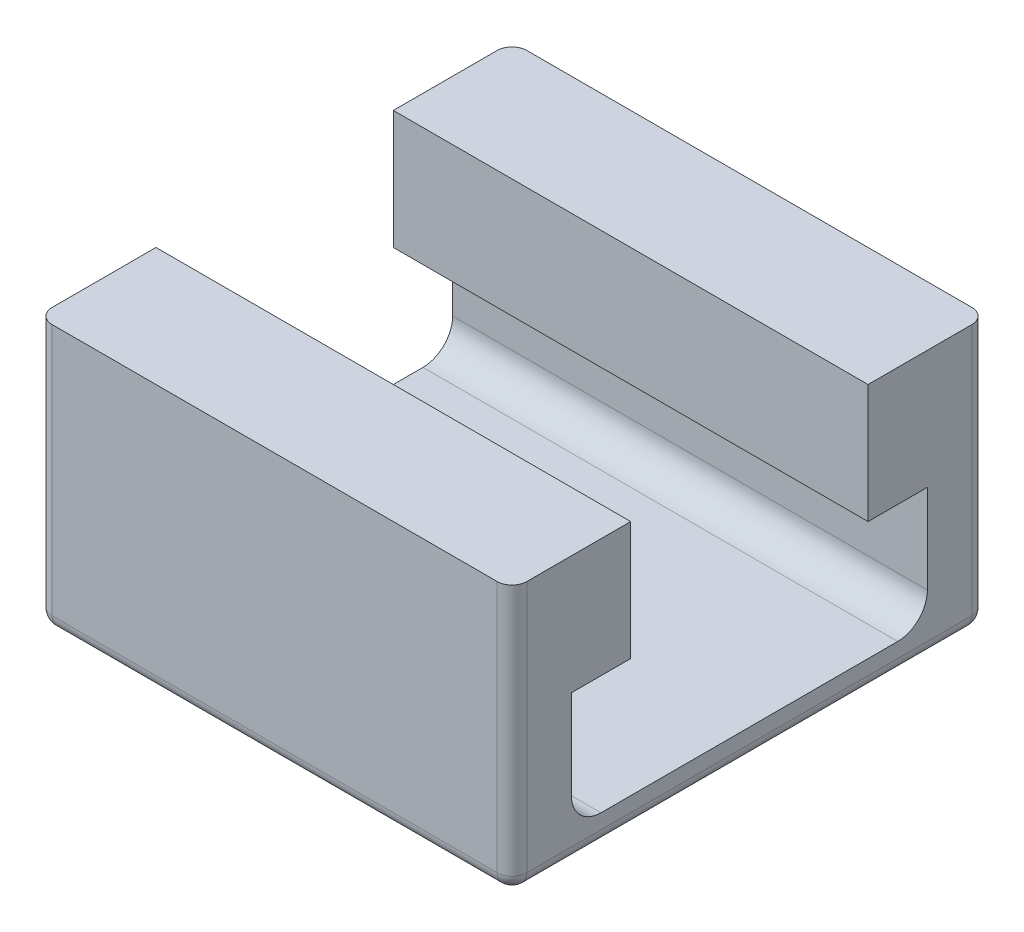
ISO-10303-21;
HEADER;
FILE_DESCRIPTION(('STEP AP214'),'2;1');
FILE_NAME('part.step','',(''),(''),'','','');
FILE_SCHEMA(('AUTOMOTIVE_DESIGN { 1 0 10303 214 1 1 1 1 }'));
ENDSEC;
DATA;
#1=APPLICATION_CONTEXT('core data for automotive mechanical design processes');
#2=APPLICATION_PROTOCOL_DEFINITION('international standard','automotive_design',2000,#1);
#3=PRODUCT_CONTEXT('',#1,'mechanical');
#4=PRODUCT('Part','Part','',(#3));
#5=PRODUCT_RELATED_PRODUCT_CATEGORY('part','',(#4));
#6=PRODUCT_DEFINITION_FORMATION('','',#4);
#7=PRODUCT_DEFINITION_CONTEXT('part definition',#1,'design');
#8=PRODUCT_DEFINITION('design','',#6,#7);
#9=PRODUCT_DEFINITION_SHAPE('','',#8);
#10=(LENGTH_UNIT() NAMED_UNIT(*) SI_UNIT(.MILLI.,.METRE.));
#11=(NAMED_UNIT(*) PLANE_ANGLE_UNIT() SI_UNIT($,.RADIAN.));
#12=(NAMED_UNIT(*) SI_UNIT($,.STERADIAN.) SOLID_ANGLE_UNIT());
#13=UNCERTAINTY_MEASURE_WITH_UNIT(LENGTH_MEASURE(1.E-05),#10,'distance_accuracy_value','');
#14=(GEOMETRIC_REPRESENTATION_CONTEXT(3) GLOBAL_UNCERTAINTY_ASSIGNED_CONTEXT((#13)) GLOBAL_UNIT_ASSIGNED_CONTEXT((#10,
#11,#12)) REPRESENTATION_CONTEXT('',''));
#15=CARTESIAN_POINT('',(0.,0.,0.));
#16=DIRECTION('',(0.,0.,1.));
#17=DIRECTION('',(1.,0.,0.));
#18=AXIS2_PLACEMENT_3D('',#15,#16,#17);
#19=CARTESIAN_POINT('',(-8.,0.,0.));
#20=DIRECTION('',(0.,-1.,0.));
#21=DIRECTION('',(0.,0.,-1.));
#22=AXIS2_PLACEMENT_3D('',#19,#20,#21);
#23=PLANE('',#22);
#24=DIRECTION('',(1.,0.,0.));
#25=VECTOR('',#24,1.);
#26=CARTESIAN_POINT('',(-8.,0.,-0.25));
#27=LINE('',#26,#25);
#28=CARTESIAN_POINT('',(-0.25,0.,-0.25));
#29=VERTEX_POINT('',#28);
#30=CARTESIAN_POINT('',(-7.75,0.,-0.25));
#31=VERTEX_POINT('',#30);
#32=EDGE_CURVE('E276',#29,#31,#27,.F.);
#33=ORIENTED_EDGE('',*,*,#32,.T.);
#34=DIRECTION('',(0.,0.,-1.));
#35=VECTOR('',#34,1.);
#36=CARTESIAN_POINT('',(-7.75,0.,-8.));
#37=LINE('',#36,#35);
#38=CARTESIAN_POINT('',(-7.75,0.,-7.75));
#39=VERTEX_POINT('',#38);
#40=EDGE_CURVE('E281',#31,#39,#37,.T.);
#41=ORIENTED_EDGE('',*,*,#40,.T.);
#42=DIRECTION('',(1.,0.,0.));
#43=VECTOR('',#42,1.);
#44=CARTESIAN_POINT('',(-8.,0.,-7.75));
#45=LINE('',#44,#43);
#46=CARTESIAN_POINT('',(-0.25,0.,-7.75));
#47=VERTEX_POINT('',#46);
#48=EDGE_CURVE('E278',#39,#47,#45,.T.);
#49=ORIENTED_EDGE('',*,*,#48,.T.);
#50=DIRECTION('',(0.,0.,-1.));
#51=VECTOR('',#50,1.);
#52=CARTESIAN_POINT('',(-0.25,0.,0.));
#53=LINE('',#52,#51);
#54=EDGE_CURVE('E255',#47,#29,#53,.F.);
#55=ORIENTED_EDGE('',*,*,#54,.T.);
#56=EDGE_LOOP('',(#33,#41,#49,#55));
#57=FACE_BOUND('',#56,.T.);
#58=ADVANCED_FACE('F32',(#57),#23,.T.);
#59=CARTESIAN_POINT('',(-8.,0.,0.));
#60=DIRECTION('',(0.,0.,1.));
#61=DIRECTION('',(1.,0.,0.));
#62=AXIS2_PLACEMENT_3D('',#59,#60,#61);
#63=PLANE('',#62);
#64=DIRECTION('',(1.,0.,0.));
#65=VECTOR('',#64,1.);
#66=CARTESIAN_POINT('',(-8.,4.5,0.));
#67=LINE('',#66,#65);
#68=CARTESIAN_POINT('',(-7.75,4.5,0.));
#69=VERTEX_POINT('',#68);
#70=CARTESIAN_POINT('',(-0.25,4.5,0.));
#71=VERTEX_POINT('',#70);
#72=EDGE_CURVE('E252',#69,#71,#67,.T.);
#73=ORIENTED_EDGE('',*,*,#72,.F.);
#74=DIRECTION('',(0.,-1.,0.));
#75=VECTOR('',#74,1.);
#76=CARTESIAN_POINT('',(-7.75,0.,0.));
#77=LINE('',#76,#75);
#78=CARTESIAN_POINT('',(-7.75,0.25,0.));
#79=VERTEX_POINT('',#78);
#80=EDGE_CURVE('E303',#69,#79,#77,.T.);
#81=ORIENTED_EDGE('',*,*,#80,.T.);
#82=DIRECTION('',(1.,0.,0.));
#83=VECTOR('',#82,1.);
#84=CARTESIAN_POINT('',(-8.,0.25,0.));
#85=LINE('',#84,#83);
#86=CARTESIAN_POINT('',(-0.25,0.25,0.));
#87=VERTEX_POINT('',#86);
#88=EDGE_CURVE('E301',#79,#87,#85,.T.);
#89=ORIENTED_EDGE('',*,*,#88,.T.);
#90=DIRECTION('',(0.,-1.,0.));
#91=VECTOR('',#90,1.);
#92=CARTESIAN_POINT('',(-0.25,0.,0.));
#93=LINE('',#92,#91);
#94=EDGE_CURVE('E299',#87,#71,#93,.F.);
#95=ORIENTED_EDGE('',*,*,#94,.T.);
#96=EDGE_LOOP('',(#73,#81,#89,#95));
#97=FACE_BOUND('',#96,.T.);
#98=ADVANCED_FACE('F367',(#97),#63,.T.);
#99=CARTESIAN_POINT('',(-8.,4.5,0.));
#100=DIRECTION('',(0.,1.,0.));
#101=DIRECTION('',(0.,0.,1.));
#102=AXIS2_PLACEMENT_3D('',#99,#100,#101);
#103=PLANE('',#102);
#104=DIRECTION('',(0.,0.,1.));
#105=VECTOR('',#104,1.);
#106=CARTESIAN_POINT('',(-8.,4.5,0.));
#107=LINE('',#106,#105);
#108=CARTESIAN_POINT('',(-8.,4.5,-1.99999999999999));
#109=VERTEX_POINT('',#108);
#110=CARTESIAN_POINT('',(-8.,4.5,-0.25));
#111=VERTEX_POINT('',#110);
#112=EDGE_CURVE('E221',#109,#111,#107,.T.);
#113=ORIENTED_EDGE('',*,*,#112,.T.);
#114=CARTESIAN_POINT('',(-7.75,4.5,-0.25));
#115=DIRECTION('',(0.,1.,0.));
#116=DIRECTION('',(0.,0.,1.));
#117=AXIS2_PLACEMENT_3D('',#114,#115,#116);
#118=CIRCLE('',#117,0.25);
#119=EDGE_CURVE('E307',#111,#69,#118,.T.);
#120=ORIENTED_EDGE('',*,*,#119,.T.);
#121=ORIENTED_EDGE('',*,*,#72,.T.);
#122=CARTESIAN_POINT('',(-0.25,4.5,-0.25));
#123=DIRECTION('',(0.,1.,0.));
#124=DIRECTION('',(0.,0.,1.));
#125=AXIS2_PLACEMENT_3D('',#122,#123,#124);
#126=CIRCLE('',#125,0.25);
#127=CARTESIAN_POINT('',(0.,4.5,-0.25));
#128=VERTEX_POINT('',#127);
#129=EDGE_CURVE('E305',#71,#128,#126,.T.);
#130=ORIENTED_EDGE('',*,*,#129,.T.);
#131=DIRECTION('',(0.,0.,1.));
#132=VECTOR('',#131,1.);
#133=CARTESIAN_POINT('',(0.,4.5,0.));
#134=LINE('',#133,#132);
#135=CARTESIAN_POINT('',(0.,4.5,-1.99999999999999));
#136=VERTEX_POINT('',#135);
#137=EDGE_CURVE('E182',#136,#128,#134,.T.);
#138=ORIENTED_EDGE('',*,*,#137,.F.);
#139=DIRECTION('',(1.,0.,0.));
#140=VECTOR('',#139,1.);
#141=CARTESIAN_POINT('',(-8.,4.5,-1.99999999999999));
#142=LINE('',#141,#140);
#143=EDGE_CURVE('E256',#109,#136,#142,.T.);
#144=ORIENTED_EDGE('',*,*,#143,.F.);
#145=EDGE_LOOP('',(#113,#120,#121,#130,#138,#144));
#146=FACE_BOUND('',#145,.T.);
#147=ADVANCED_FACE('F374',(#146),#103,.T.);
#148=CARTESIAN_POINT('',(-8.,4.5,-1.99999999999999));
#149=DIRECTION('',(0.,0.,-1.));
#150=DIRECTION('',(-1.,0.,0.));
#151=AXIS2_PLACEMENT_3D('',#148,#149,#150);
#152=PLANE('',#151);
#153=DIRECTION('',(0.,1.,0.));
#154=VECTOR('',#153,1.);
#155=CARTESIAN_POINT('',(0.,4.5,-1.99999999999999));
#156=LINE('',#155,#154);
#157=CARTESIAN_POINT('',(0.,2.50000000000034,-1.99999999999999));
#158=VERTEX_POINT('',#157);
#159=EDGE_CURVE('E248',#158,#136,#156,.T.);
#160=ORIENTED_EDGE('',*,*,#159,.F.);
#161=DIRECTION('',(1.,0.,0.));
#162=VECTOR('',#161,1.);
#163=CARTESIAN_POINT('',(-8.,2.50000000000034,-1.99999999999999));
#164=LINE('',#163,#162);
#165=CARTESIAN_POINT('',(-8.,2.50000000000034,-1.99999999999999));
#166=VERTEX_POINT('',#165);
#167=EDGE_CURVE('E258',#166,#158,#164,.T.);
#168=ORIENTED_EDGE('',*,*,#167,.F.);
#169=DIRECTION('',(0.,1.,0.));
#170=VECTOR('',#169,1.);
#171=CARTESIAN_POINT('',(-8.,4.5,-1.99999999999999));
#172=LINE('',#171,#170);
#173=EDGE_CURVE('E218',#166,#109,#172,.T.);
#174=ORIENTED_EDGE('',*,*,#173,.T.);
#175=ORIENTED_EDGE('',*,*,#143,.T.);
#176=EDGE_LOOP('',(#160,#168,#174,#175));
#177=FACE_BOUND('',#176,.T.);
#178=ADVANCED_FACE('F379',(#177),#152,.T.);
#179=CARTESIAN_POINT('',(-8.,2.50000000000034,-1.99999999999999));
#180=DIRECTION('',(0.,-1.,0.));
#181=DIRECTION('',(0.,0.,-1.));
#182=AXIS2_PLACEMENT_3D('',#179,#180,#181);
#183=PLANE('',#182);
#184=DIRECTION('',(0.,0.,-1.));
#185=VECTOR('',#184,1.);
#186=CARTESIAN_POINT('',(0.,2.50000000000034,-1.99999999999999));
#187=LINE('',#186,#185);
#188=CARTESIAN_POINT('',(0.,2.50000000000034,-1.));
#189=VERTEX_POINT('',#188);
#190=EDGE_CURVE('E245',#189,#158,#187,.T.);
#191=ORIENTED_EDGE('',*,*,#190,.F.);
#192=DIRECTION('',(1.,0.,0.));
#193=VECTOR('',#192,1.);
#194=CARTESIAN_POINT('',(-8.,2.50000000000034,-1.));
#195=LINE('',#194,#193);
#196=CARTESIAN_POINT('',(-8.,2.50000000000034,-1.));
#197=VERTEX_POINT('',#196);
#198=EDGE_CURVE('E260',#197,#189,#195,.T.);
#199=ORIENTED_EDGE('',*,*,#198,.F.);
#200=DIRECTION('',(0.,0.,-1.));
#201=VECTOR('',#200,1.);
#202=CARTESIAN_POINT('',(-8.,2.50000000000034,-1.99999999999999));
#203=LINE('',#202,#201);
#204=EDGE_CURVE('E215',#197,#166,#203,.T.);
#205=ORIENTED_EDGE('',*,*,#204,.T.);
#206=ORIENTED_EDGE('',*,*,#167,.T.);
#207=EDGE_LOOP('',(#191,#199,#205,#206));
#208=FACE_BOUND('',#207,.T.);
#209=ADVANCED_FACE('F588',(#208),#183,.T.);
#210=CARTESIAN_POINT('',(-8.,2.50000000000034,-1.));
#211=DIRECTION('',(0.,0.,-1.));
#212=DIRECTION('',(-1.,0.,0.));
#213=AXIS2_PLACEMENT_3D('',#210,#211,#212);
#214=PLANE('',#213);
#215=DIRECTION('',(0.,1.,0.));
#216=VECTOR('',#215,1.);
#217=CARTESIAN_POINT('',(0.,2.50000000000034,-1.));
#218=LINE('',#217,#216);
#219=CARTESIAN_POINT('',(0.,1.,-1.));
#220=VERTEX_POINT('',#219);
#221=EDGE_CURVE('E242',#220,#189,#218,.T.);
#222=ORIENTED_EDGE('',*,*,#221,.F.);
#223=DIRECTION('',(1.,0.,0.));
#224=VECTOR('',#223,1.);
#225=CARTESIAN_POINT('',(-8.,1.,-1.));
#226=LINE('',#225,#224);
#227=CARTESIAN_POINT('',(-8.,1.,-1.));
#228=VERTEX_POINT('',#227);
#229=EDGE_CURVE('E262',#228,#220,#226,.T.);
#230=ORIENTED_EDGE('',*,*,#229,.F.);
#231=DIRECTION('',(0.,1.,0.));
#232=VECTOR('',#231,1.);
#233=CARTESIAN_POINT('',(-8.,2.50000000000034,-1.));
#234=LINE('',#233,#232);
#235=EDGE_CURVE('E212',#228,#197,#234,.T.);
#236=ORIENTED_EDGE('',*,*,#235,.T.);
#237=ORIENTED_EDGE('',*,*,#198,.T.);
#238=EDGE_LOOP('',(#222,#230,#236,#237));
#239=FACE_BOUND('',#238,.T.);
#240=ADVANCED_FACE('F579',(#239),#214,.T.);
#241=CARTESIAN_POINT('',(-8.,1.,-1.5));
#242=DIRECTION('',(1.,0.,0.));
#243=DIRECTION('',(0.,0.,-1.));
#244=AXIS2_PLACEMENT_3D('',#241,#242,#243);
#245=CYLINDRICAL_SURFACE('',#244,0.5);
#246=CARTESIAN_POINT('',(0.,1.,-1.5));
#247=DIRECTION('',(-1.,0.,0.));
#248=DIRECTION('',(0.,0.,-1.));
#249=AXIS2_PLACEMENT_3D('',#246,#247,#248);
#250=CIRCLE('',#249,0.5);
#251=CARTESIAN_POINT('',(0.,0.500000000000004,-1.5));
#252=VERTEX_POINT('',#251);
#253=EDGE_CURVE('E239',#252,#220,#250,.T.);
#254=ORIENTED_EDGE('',*,*,#253,.F.);
#255=DIRECTION('',(1.,0.,0.));
#256=VECTOR('',#255,1.);
#257=CARTESIAN_POINT('',(-8.,0.500000000000004,-1.5));
#258=LINE('',#257,#256);
#259=CARTESIAN_POINT('',(-8.,0.500000000000004,-1.5));
#260=VERTEX_POINT('',#259);
#261=EDGE_CURVE('E264',#260,#252,#258,.T.);
#262=ORIENTED_EDGE('',*,*,#261,.F.);
#263=CARTESIAN_POINT('',(-8.,1.,-1.5));
#264=DIRECTION('',(-1.,0.,0.));
#265=DIRECTION('',(0.,0.,-1.));
#266=AXIS2_PLACEMENT_3D('',#263,#264,#265);
#267=CIRCLE('',#266,0.5);
#268=EDGE_CURVE('E209',#260,#228,#267,.T.);
#269=ORIENTED_EDGE('',*,*,#268,.T.);
#270=ORIENTED_EDGE('',*,*,#229,.T.);
#271=EDGE_LOOP('',(#254,#262,#269,#270));
#272=FACE_BOUND('',#271,.T.);
#273=ADVANCED_FACE('F570',(#272),#245,.F.);
#274=CARTESIAN_POINT('',(-8.,0.500000000000004,-6.50000000000003));
#275=DIRECTION('',(0.,1.,0.));
#276=DIRECTION('',(0.,0.,1.));
#277=AXIS2_PLACEMENT_3D('',#274,#275,#276);
#278=PLANE('',#277);
#279=DIRECTION('',(0.,0.,1.));
#280=VECTOR('',#279,1.);
#281=CARTESIAN_POINT('',(0.,0.500000000000004,-6.50000000000003));
#282=LINE('',#281,#280);
#283=CARTESIAN_POINT('',(0.,0.500000000000004,-6.50000000000003));
#284=VERTEX_POINT('',#283);
#285=EDGE_CURVE('E236',#284,#252,#282,.T.);
#286=ORIENTED_EDGE('',*,*,#285,.F.);
#287=DIRECTION('',(1.,0.,0.));
#288=VECTOR('',#287,1.);
#289=CARTESIAN_POINT('',(-8.,0.500000000000004,-6.50000000000003));
#290=LINE('',#289,#288);
#291=CARTESIAN_POINT('',(-8.,0.500000000000004,-6.50000000000003));
#292=VERTEX_POINT('',#291);
#293=EDGE_CURVE('E266',#292,#284,#290,.T.);
#294=ORIENTED_EDGE('',*,*,#293,.F.);
#295=DIRECTION('',(0.,0.,1.));
#296=VECTOR('',#295,1.);
#297=CARTESIAN_POINT('',(-8.,0.500000000000004,-6.50000000000003));
#298=LINE('',#297,#296);
#299=EDGE_CURVE('E206',#292,#260,#298,.T.);
#300=ORIENTED_EDGE('',*,*,#299,.T.);
#301=ORIENTED_EDGE('',*,*,#261,.T.);
#302=EDGE_LOOP('',(#286,#294,#300,#301));
#303=FACE_BOUND('',#302,.T.);
#304=ADVANCED_FACE('F561',(#303),#278,.T.);
#305=CARTESIAN_POINT('',(-8.,1.,-6.50000000000003));
#306=DIRECTION('',(1.,0.,0.));
#307=DIRECTION('',(0.,0.,-1.));
#308=AXIS2_PLACEMENT_3D('',#305,#306,#307);
#309=CYLINDRICAL_SURFACE('',#308,0.499999999999999);
#310=CARTESIAN_POINT('',(0.,1.,-6.50000000000003));
#311=DIRECTION('',(-1.,0.,0.));
#312=DIRECTION('',(0.,0.,-1.));
#313=AXIS2_PLACEMENT_3D('',#310,#311,#312);
#314=CIRCLE('',#313,0.499999999999999);
#315=CARTESIAN_POINT('',(0.,1.,-7.00000000000002));
#316=VERTEX_POINT('',#315);
#317=EDGE_CURVE('E233',#316,#284,#314,.T.);
#318=ORIENTED_EDGE('',*,*,#317,.F.);
#319=DIRECTION('',(1.,0.,0.));
#320=VECTOR('',#319,1.);
#321=CARTESIAN_POINT('',(-8.,1.,-7.00000000000002));
#322=LINE('',#321,#320);
#323=CARTESIAN_POINT('',(-8.,1.,-7.00000000000002));
#324=VERTEX_POINT('',#323);
#325=EDGE_CURVE('E268',#324,#316,#322,.T.);
#326=ORIENTED_EDGE('',*,*,#325,.F.);
#327=CARTESIAN_POINT('',(-8.,1.,-6.50000000000003));
#328=DIRECTION('',(-1.,0.,0.));
#329=DIRECTION('',(0.,0.,-1.));
#330=AXIS2_PLACEMENT_3D('',#327,#328,#329);
#331=CIRCLE('',#330,0.499999999999999);
#332=EDGE_CURVE('E203',#324,#292,#331,.T.);
#333=ORIENTED_EDGE('',*,*,#332,.T.);
#334=ORIENTED_EDGE('',*,*,#293,.T.);
#335=EDGE_LOOP('',(#318,#326,#333,#334));
#336=FACE_BOUND('',#335,.T.);
#337=ADVANCED_FACE('F552',(#336),#309,.F.);
#338=CARTESIAN_POINT('',(-8.,2.5,-7.00000000000003));
#339=DIRECTION('',(0.,0.,1.));
#340=DIRECTION('',(1.,0.,0.));
#341=AXIS2_PLACEMENT_3D('',#338,#339,#340);
#342=PLANE('',#341);
#343=DIRECTION('',(0.,-1.,0.));
#344=VECTOR('',#343,1.);
#345=CARTESIAN_POINT('',(0.,2.5,-7.00000000000003));
#346=LINE('',#345,#344);
#347=CARTESIAN_POINT('',(0.,2.5,-7.00000000000003));
#348=VERTEX_POINT('',#347);
#349=EDGE_CURVE('E230',#348,#316,#346,.T.);
#350=ORIENTED_EDGE('',*,*,#349,.F.);
#351=DIRECTION('',(1.,0.,0.));
#352=VECTOR('',#351,1.);
#353=CARTESIAN_POINT('',(-8.,2.5,-7.00000000000003));
#354=LINE('',#353,#352);
#355=CARTESIAN_POINT('',(-8.,2.5,-7.00000000000003));
#356=VERTEX_POINT('',#355);
#357=EDGE_CURVE('E270',#356,#348,#354,.T.);
#358=ORIENTED_EDGE('',*,*,#357,.F.);
#359=DIRECTION('',(0.,-1.,0.));
#360=VECTOR('',#359,1.);
#361=CARTESIAN_POINT('',(-8.,2.5,-7.00000000000003));
#362=LINE('',#361,#360);
#363=EDGE_CURVE('E198',#356,#324,#362,.T.);
#364=ORIENTED_EDGE('',*,*,#363,.T.);
#365=ORIENTED_EDGE('',*,*,#325,.T.);
#366=EDGE_LOOP('',(#350,#358,#364,#365));
#367=FACE_BOUND('',#366,.T.);
#368=ADVANCED_FACE('F543',(#367),#342,.T.);
#369=CARTESIAN_POINT('',(-8.,2.5,-6.));
#370=DIRECTION('',(0.,-1.,0.));
#371=DIRECTION('',(0.,0.,-1.));
#372=AXIS2_PLACEMENT_3D('',#369,#370,#371);
#373=PLANE('',#372);
#374=DIRECTION('',(0.,0.,-1.));
#375=VECTOR('',#374,1.);
#376=CARTESIAN_POINT('',(0.,2.5,-6.));
#377=LINE('',#376,#375);
#378=CARTESIAN_POINT('',(0.,2.5,-6.));
#379=VERTEX_POINT('',#378);
#380=EDGE_CURVE('E227',#379,#348,#377,.T.);
#381=ORIENTED_EDGE('',*,*,#380,.F.);
#382=DIRECTION('',(1.,0.,0.));
#383=VECTOR('',#382,1.);
#384=CARTESIAN_POINT('',(-8.,2.5,-6.));
#385=LINE('',#384,#383);
#386=CARTESIAN_POINT('',(-8.,2.5,-6.));
#387=VERTEX_POINT('',#386);
#388=EDGE_CURVE('E189',#387,#379,#385,.T.);
#389=ORIENTED_EDGE('',*,*,#388,.F.);
#390=DIRECTION('',(0.,0.,-1.));
#391=VECTOR('',#390,1.);
#392=CARTESIAN_POINT('',(-8.,2.5,-6.));
#393=LINE('',#392,#391);
#394=EDGE_CURVE('E196',#387,#356,#393,.T.);
#395=ORIENTED_EDGE('',*,*,#394,.T.);
#396=ORIENTED_EDGE('',*,*,#357,.T.);
#397=EDGE_LOOP('',(#381,#389,#395,#396));
#398=FACE_BOUND('',#397,.T.);
#399=ADVANCED_FACE('F535',(#398),#373,.T.);
#400=CARTESIAN_POINT('',(-8.,4.50000000000023,-6.));
#401=DIRECTION('',(0.,0.,1.));
#402=DIRECTION('',(1.,0.,0.));
#403=AXIS2_PLACEMENT_3D('',#400,#401,#402);
#404=PLANE('',#403);
#405=DIRECTION('',(0.,-1.,0.));
#406=VECTOR('',#405,1.);
#407=CARTESIAN_POINT('',(0.,4.50000000000023,-6.));
#408=LINE('',#407,#406);
#409=CARTESIAN_POINT('',(0.,4.50000000000023,-6.));
#410=VERTEX_POINT('',#409);
#411=EDGE_CURVE('E188',#410,#379,#408,.T.);
#412=ORIENTED_EDGE('',*,*,#411,.F.);
#413=DIRECTION('',(1.,0.,0.));
#414=VECTOR('',#413,1.);
#415=CARTESIAN_POINT('',(-8.,4.50000000000023,-6.));
#416=LINE('',#415,#414);
#417=CARTESIAN_POINT('',(-8.,4.50000000000023,-6.));
#418=VERTEX_POINT('',#417);
#419=EDGE_CURVE('E174',#418,#410,#416,.T.);
#420=ORIENTED_EDGE('',*,*,#419,.F.);
#421=DIRECTION('',(0.,-1.,0.));
#422=VECTOR('',#421,1.);
#423=CARTESIAN_POINT('',(-8.,4.50000000000023,-6.));
#424=LINE('',#423,#422);
#425=EDGE_CURVE('E181',#418,#387,#424,.T.);
#426=ORIENTED_EDGE('',*,*,#425,.T.);
#427=ORIENTED_EDGE('',*,*,#388,.T.);
#428=EDGE_LOOP('',(#412,#420,#426,#427));
#429=FACE_BOUND('',#428,.T.);
#430=ADVANCED_FACE('F186',(#429),#404,.T.);
#431=CARTESIAN_POINT('',(-8.,4.50000000000023,-8.));
#432=DIRECTION('',(0.,1.,0.));
#433=DIRECTION('',(0.,0.,1.));
#434=AXIS2_PLACEMENT_3D('',#431,#432,#433);
#435=PLANE('',#434);
#436=DIRECTION('',(1.,0.,0.));
#437=VECTOR('',#436,1.);
#438=CARTESIAN_POINT('',(-8.,4.50000000000023,-8.));
#439=LINE('',#438,#437);
#440=CARTESIAN_POINT('',(-7.75,4.50000000000023,-8.));
#441=VERTEX_POINT('',#440);
#442=CARTESIAN_POINT('',(-0.25,4.50000000000023,-8.));
#443=VERTEX_POINT('',#442);
#444=EDGE_CURVE('E190',#441,#443,#439,.T.);
#445=ORIENTED_EDGE('',*,*,#444,.F.);
#446=CARTESIAN_POINT('',(-7.75,4.50000000000023,-7.75));
#447=DIRECTION('',(0.,1.,0.));
#448=DIRECTION('',(0.,0.,1.));
#449=AXIS2_PLACEMENT_3D('',#446,#447,#448);
#450=CIRCLE('',#449,0.25);
#451=CARTESIAN_POINT('',(-8.,4.50000000000023,-7.75));
#452=VERTEX_POINT('',#451);
#453=EDGE_CURVE('E177',#441,#452,#450,.T.);
#454=ORIENTED_EDGE('',*,*,#453,.T.);
#455=DIRECTION('',(0.,0.,1.));
#456=VECTOR('',#455,1.);
#457=CARTESIAN_POINT('',(-8.,4.50000000000023,-8.));
#458=LINE('',#457,#456);
#459=EDGE_CURVE('E169',#452,#418,#458,.T.);
#460=ORIENTED_EDGE('',*,*,#459,.T.);
#461=ORIENTED_EDGE('',*,*,#419,.T.);
#462=DIRECTION('',(0.,0.,1.));
#463=VECTOR('',#462,1.);
#464=CARTESIAN_POINT('',(0.,4.50000000000023,-8.));
#465=LINE('',#464,#463);
#466=CARTESIAN_POINT('',(0.,4.50000000000023,-7.75));
#467=VERTEX_POINT('',#466);
#468=EDGE_CURVE('E224',#467,#410,#465,.T.);
#469=ORIENTED_EDGE('',*,*,#468,.F.);
#470=CARTESIAN_POINT('',(-0.25,4.50000000000023,-7.75));
#471=DIRECTION('',(0.,1.,0.));
#472=DIRECTION('',(0.,0.,1.));
#473=AXIS2_PLACEMENT_3D('',#470,#471,#472);
#474=CIRCLE('',#473,0.25);
#475=EDGE_CURVE('E290',#467,#443,#474,.T.);
#476=ORIENTED_EDGE('',*,*,#475,.T.);
#477=EDGE_LOOP('',(#445,#454,#460,#461,#469,#476));
#478=FACE_BOUND('',#477,.T.);
#479=ADVANCED_FACE('F172',(#478),#435,.T.);
#480=CARTESIAN_POINT('',(-8.,0.,-8.));
#481=DIRECTION('',(0.,0.,-1.));
#482=DIRECTION('',(-1.,0.,0.));
#483=AXIS2_PLACEMENT_3D('',#480,#481,#482);
#484=PLANE('',#483);
#485=DIRECTION('',(1.,0.,0.));
#486=VECTOR('',#485,1.);
#487=CARTESIAN_POINT('',(-8.,0.25,-8.));
#488=LINE('',#487,#486);
#489=CARTESIAN_POINT('',(-0.25,0.25,-8.));
#490=VERTEX_POINT('',#489);
#491=CARTESIAN_POINT('',(-7.75,0.25,-8.));
#492=VERTEX_POINT('',#491);
#493=EDGE_CURVE('E285',#490,#492,#488,.F.);
#494=ORIENTED_EDGE('',*,*,#493,.T.);
#495=DIRECTION('',(0.,1.,0.));
#496=VECTOR('',#495,1.);
#497=CARTESIAN_POINT('',(-7.75,4.50000000000023,-8.));
#498=LINE('',#497,#496);
#499=EDGE_CURVE('E288',#492,#441,#498,.T.);
#500=ORIENTED_EDGE('',*,*,#499,.T.);
#501=ORIENTED_EDGE('',*,*,#444,.T.);
#502=DIRECTION('',(0.,1.,0.));
#503=VECTOR('',#502,1.);
#504=CARTESIAN_POINT('',(-0.25,0.,-8.));
#505=LINE('',#504,#503);
#506=EDGE_CURVE('E283',#443,#490,#505,.F.);
#507=ORIENTED_EDGE('',*,*,#506,.T.);
#508=EDGE_LOOP('',(#494,#500,#501,#507));
#509=FACE_BOUND('',#508,.T.);
#510=ADVANCED_FACE('F398',(#509),#484,.T.);
#511=CARTESIAN_POINT('',(-8.,1.,-6.50000000000003));
#512=DIRECTION('',(1.,0.,0.));
#513=DIRECTION('',(0.,0.,-1.));
#514=AXIS2_PLACEMENT_3D('',#511,#512,#513);
#515=PLANE('',#514);
#516=ORIENTED_EDGE('',*,*,#459,.F.);
#517=DIRECTION('',(0.,1.,0.));
#518=VECTOR('',#517,1.);
#519=CARTESIAN_POINT('',(-8.,0.,-7.75));
#520=LINE('',#519,#518);
#521=CARTESIAN_POINT('',(-8.,0.25,-7.75));
#522=VERTEX_POINT('',#521);
#523=EDGE_CURVE('E297',#452,#522,#520,.F.);
#524=ORIENTED_EDGE('',*,*,#523,.T.);
#525=DIRECTION('',(0.,0.,-1.));
#526=VECTOR('',#525,1.);
#527=CARTESIAN_POINT('',(-8.,0.25,0.));
#528=LINE('',#527,#526);
#529=CARTESIAN_POINT('',(-8.,0.25,-0.25));
#530=VERTEX_POINT('',#529);
#531=EDGE_CURVE('E295',#522,#530,#528,.F.);
#532=ORIENTED_EDGE('',*,*,#531,.T.);
#533=DIRECTION('',(0.,-1.,0.));
#534=VECTOR('',#533,1.);
#535=CARTESIAN_POINT('',(-8.,4.5,-0.25));
#536=LINE('',#535,#534);
#537=EDGE_CURVE('E293',#530,#111,#536,.F.);
#538=ORIENTED_EDGE('',*,*,#537,.T.);
#539=ORIENTED_EDGE('',*,*,#112,.F.);
#540=ORIENTED_EDGE('',*,*,#173,.F.);
#541=ORIENTED_EDGE('',*,*,#204,.F.);
#542=ORIENTED_EDGE('',*,*,#235,.F.);
#543=ORIENTED_EDGE('',*,*,#268,.F.);
#544=ORIENTED_EDGE('',*,*,#299,.F.);
#545=ORIENTED_EDGE('',*,*,#332,.F.);
#546=ORIENTED_EDGE('',*,*,#363,.F.);
#547=ORIENTED_EDGE('',*,*,#394,.F.);
#548=ORIENTED_EDGE('',*,*,#425,.F.);
#549=EDGE_LOOP('',(#516,#524,#532,#538,#539,#540,#541,#542,#543,#544,#545,#546,#547,#548));
#550=FACE_BOUND('',#549,.T.);
#551=ADVANCED_FACE('F193',(#550),#515,.F.);
#552=CARTESIAN_POINT('',(0.,1.,-6.50000000000003));
#553=DIRECTION('',(1.,0.,0.));
#554=DIRECTION('',(0.,0.,-1.));
#555=AXIS2_PLACEMENT_3D('',#552,#553,#554);
#556=PLANE('',#555);
#557=DIRECTION('',(0.,0.,-1.));
#558=VECTOR('',#557,1.);
#559=CARTESIAN_POINT('',(0.,0.25,-6.50000000000003));
#560=LINE('',#559,#558);
#561=CARTESIAN_POINT('',(0.,0.25,-0.25));
#562=VERTEX_POINT('',#561);
#563=CARTESIAN_POINT('',(0.,0.25,-7.75));
#564=VERTEX_POINT('',#563);
#565=EDGE_CURVE('E41',#562,#564,#560,.T.);
#566=ORIENTED_EDGE('',*,*,#565,.T.);
#567=DIRECTION('',(0.,1.,0.));
#568=VECTOR('',#567,1.);
#569=CARTESIAN_POINT('',(0.,1.,-7.75));
#570=LINE('',#569,#568);
#571=EDGE_CURVE('E11',#564,#467,#570,.T.);
#572=ORIENTED_EDGE('',*,*,#571,.T.);
#573=ORIENTED_EDGE('',*,*,#468,.T.);
#574=ORIENTED_EDGE('',*,*,#411,.T.);
#575=ORIENTED_EDGE('',*,*,#380,.T.);
#576=ORIENTED_EDGE('',*,*,#349,.T.);
#577=ORIENTED_EDGE('',*,*,#317,.T.);
#578=ORIENTED_EDGE('',*,*,#285,.T.);
#579=ORIENTED_EDGE('',*,*,#253,.T.);
#580=ORIENTED_EDGE('',*,*,#221,.T.);
#581=ORIENTED_EDGE('',*,*,#190,.T.);
#582=ORIENTED_EDGE('',*,*,#159,.T.);
#583=ORIENTED_EDGE('',*,*,#137,.T.);
#584=DIRECTION('',(0.,-1.,0.));
#585=VECTOR('',#584,1.);
#586=CARTESIAN_POINT('',(0.,1.,-0.25));
#587=LINE('',#586,#585);
#588=EDGE_CURVE('E52',#128,#562,#587,.T.);
#589=ORIENTED_EDGE('',*,*,#588,.T.);
#590=EDGE_LOOP('',(#566,#572,#573,#574,#575,#576,#577,#578,#579,#580,#581,#582,#583,#589));
#591=FACE_BOUND('',#590,.T.);
#592=ADVANCED_FACE('F375',(#591),#556,.T.);
#593=CARTESIAN_POINT('',(-7.75,0.,-0.25));
#594=DIRECTION('',(0.,1.,0.));
#595=DIRECTION('',(0.,0.,1.));
#596=AXIS2_PLACEMENT_3D('',#593,#594,#595);
#597=CYLINDRICAL_SURFACE('',#596,0.25);
#598=ORIENTED_EDGE('',*,*,#119,.F.);
#599=ORIENTED_EDGE('',*,*,#537,.F.);
#600=CARTESIAN_POINT('',(-7.75,0.25,-0.25));
#601=DIRECTION('',(0.,-1.,0.));
#602=DIRECTION('',(0.,0.,-1.));
#603=AXIS2_PLACEMENT_3D('',#600,#601,#602);
#604=CIRCLE('',#603,0.25);
#605=EDGE_CURVE('E36',#79,#530,#604,.T.);
#606=ORIENTED_EDGE('',*,*,#605,.F.);
#607=ORIENTED_EDGE('',*,*,#80,.F.);
#608=EDGE_LOOP('',(#598,#599,#606,#607));
#609=FACE_BOUND('',#608,.T.);
#610=ADVANCED_FACE('F34',(#609),#597,.T.);
#611=CARTESIAN_POINT('',(-8.,0.25,-0.25));
#612=DIRECTION('',(1.,0.,0.));
#613=DIRECTION('',(0.,0.,-1.));
#614=AXIS2_PLACEMENT_3D('',#611,#612,#613);
#615=CYLINDRICAL_SURFACE('',#614,0.25);
#616=CARTESIAN_POINT('',(-0.25,0.25,-0.25));
#617=DIRECTION('',(1.,0.,0.));
#618=DIRECTION('',(0.,0.,-1.));
#619=AXIS2_PLACEMENT_3D('',#616,#617,#618);
#620=CIRCLE('',#619,0.25);
#621=EDGE_CURVE('E336',#87,#29,#620,.T.);
#622=ORIENTED_EDGE('',*,*,#621,.F.);
#623=ORIENTED_EDGE('',*,*,#88,.F.);
#624=CARTESIAN_POINT('',(-7.75,0.25,-0.25));
#625=DIRECTION('',(-1.,0.,0.));
#626=DIRECTION('',(0.,0.,1.));
#627=AXIS2_PLACEMENT_3D('',#624,#625,#626);
#628=CIRCLE('',#627,0.25);
#629=EDGE_CURVE('E338',#31,#79,#628,.T.);
#630=ORIENTED_EDGE('',*,*,#629,.F.);
#631=ORIENTED_EDGE('',*,*,#32,.F.);
#632=EDGE_LOOP('',(#622,#623,#630,#631));
#633=FACE_BOUND('',#632,.T.);
#634=ADVANCED_FACE('F363',(#633),#615,.T.);
#635=CARTESIAN_POINT('',(-0.25,1.,-0.25));
#636=DIRECTION('',(0.,-1.,0.));
#637=DIRECTION('',(0.,0.,-1.));
#638=AXIS2_PLACEMENT_3D('',#635,#636,#637);
#639=CYLINDRICAL_SURFACE('',#638,0.25);
#640=ORIENTED_EDGE('',*,*,#129,.F.);
#641=ORIENTED_EDGE('',*,*,#94,.F.);
#642=CARTESIAN_POINT('',(-0.25,0.25,-0.25));
#643=DIRECTION('',(0.,-1.,0.));
#644=DIRECTION('',(0.,0.,-1.));
#645=AXIS2_PLACEMENT_3D('',#642,#643,#644);
#646=CIRCLE('',#645,0.25);
#647=EDGE_CURVE('E333',#562,#87,#646,.T.);
#648=ORIENTED_EDGE('',*,*,#647,.F.);
#649=ORIENTED_EDGE('',*,*,#588,.F.);
#650=EDGE_LOOP('',(#640,#641,#648,#649));
#651=FACE_BOUND('',#650,.T.);
#652=ADVANCED_FACE('F370',(#651),#639,.T.);
#653=CARTESIAN_POINT('',(-7.75,0.25,-0.25));
#654=DIRECTION('',(0.,0.,1.));
#655=DIRECTION('',(1.,0.,0.));
#656=AXIS2_PLACEMENT_3D('',#653,#654,#655);
#657=SPHERICAL_SURFACE('',#656,0.25);
#658=ORIENTED_EDGE('',*,*,#629,.T.);
#659=ORIENTED_EDGE('',*,*,#605,.T.);
#660=CARTESIAN_POINT('',(-7.75,0.25,-0.25));
#661=DIRECTION('',(0.,0.,1.));
#662=DIRECTION('',(1.,0.,0.));
#663=AXIS2_PLACEMENT_3D('',#660,#661,#662);
#664=CIRCLE('',#663,0.25);
#665=EDGE_CURVE('E330',#31,#530,#664,.F.);
#666=ORIENTED_EDGE('',*,*,#665,.F.);
#667=EDGE_LOOP('',(#658,#659,#666));
#668=FACE_BOUND('',#667,.T.);
#669=ADVANCED_FACE('F345',(#668),#657,.T.);
#670=CARTESIAN_POINT('',(-0.25,0.25,-0.25));
#671=DIRECTION('',(0.,0.,1.));
#672=DIRECTION('',(1.,0.,0.));
#673=AXIS2_PLACEMENT_3D('',#670,#671,#672);
#674=SPHERICAL_SURFACE('',#673,0.25);
#675=ORIENTED_EDGE('',*,*,#647,.T.);
#676=ORIENTED_EDGE('',*,*,#621,.T.);
#677=CARTESIAN_POINT('',(-0.25,0.25,-0.25));
#678=DIRECTION('',(0.,0.,1.));
#679=DIRECTION('',(1.,0.,0.));
#680=AXIS2_PLACEMENT_3D('',#677,#678,#679);
#681=CIRCLE('',#680,0.25);
#682=EDGE_CURVE('E327',#562,#29,#681,.F.);
#683=ORIENTED_EDGE('',*,*,#682,.F.);
#684=EDGE_LOOP('',(#675,#676,#683));
#685=FACE_BOUND('',#684,.T.);
#686=ADVANCED_FACE('F425',(#685),#674,.T.);
#687=CARTESIAN_POINT('',(-7.75,0.,-7.75));
#688=DIRECTION('',(0.,-1.,0.));
#689=DIRECTION('',(0.,0.,-1.));
#690=AXIS2_PLACEMENT_3D('',#687,#688,#689);
#691=CYLINDRICAL_SURFACE('',#690,0.25);
#692=ORIENTED_EDGE('',*,*,#453,.F.);
#693=ORIENTED_EDGE('',*,*,#499,.F.);
#694=CARTESIAN_POINT('',(-7.75,0.25,-7.75));
#695=DIRECTION('',(0.,-1.,0.));
#696=DIRECTION('',(0.,0.,-1.));
#697=AXIS2_PLACEMENT_3D('',#694,#695,#696);
#698=CIRCLE('',#697,0.25);
#699=EDGE_CURVE('E324',#522,#492,#698,.T.);
#700=ORIENTED_EDGE('',*,*,#699,.F.);
#701=ORIENTED_EDGE('',*,*,#523,.F.);
#702=EDGE_LOOP('',(#692,#693,#700,#701));
#703=FACE_BOUND('',#702,.T.);
#704=ADVANCED_FACE('F422',(#703),#691,.T.);
#705=CARTESIAN_POINT('',(-7.75,0.25,0.));
#706=DIRECTION('',(0.,0.,1.));
#707=DIRECTION('',(1.,0.,0.));
#708=AXIS2_PLACEMENT_3D('',#705,#706,#707);
#709=CYLINDRICAL_SURFACE('',#708,0.25);
#710=ORIENTED_EDGE('',*,*,#665,.T.);
#711=ORIENTED_EDGE('',*,*,#531,.F.);
#712=CARTESIAN_POINT('',(-7.75,0.25,-7.75));
#713=DIRECTION('',(0.,0.,-1.));
#714=DIRECTION('',(-1.,0.,0.));
#715=AXIS2_PLACEMENT_3D('',#712,#713,#714);
#716=CIRCLE('',#715,0.25);
#717=EDGE_CURVE('E321',#39,#522,#716,.T.);
#718=ORIENTED_EDGE('',*,*,#717,.F.);
#719=ORIENTED_EDGE('',*,*,#40,.F.);
#720=EDGE_LOOP('',(#710,#711,#718,#719));
#721=FACE_BOUND('',#720,.T.);
#722=ADVANCED_FACE('F352',(#721),#709,.T.);
#723=CARTESIAN_POINT('',(-0.25,0.25,-6.50000000000003));
#724=DIRECTION('',(0.,0.,-1.));
#725=DIRECTION('',(-1.,0.,0.));
#726=AXIS2_PLACEMENT_3D('',#723,#724,#725);
#727=CYLINDRICAL_SURFACE('',#726,0.25);
#728=ORIENTED_EDGE('',*,*,#682,.T.);
#729=ORIENTED_EDGE('',*,*,#54,.F.);
#730=CARTESIAN_POINT('',(-0.25,0.25,-7.75));
#731=DIRECTION('',(0.,0.,-1.));
#732=DIRECTION('',(-1.,0.,0.));
#733=AXIS2_PLACEMENT_3D('',#730,#731,#732);
#734=CIRCLE('',#733,0.25);
#735=EDGE_CURVE('E318',#564,#47,#734,.T.);
#736=ORIENTED_EDGE('',*,*,#735,.F.);
#737=ORIENTED_EDGE('',*,*,#565,.F.);
#738=EDGE_LOOP('',(#728,#729,#736,#737));
#739=FACE_BOUND('',#738,.T.);
#740=ADVANCED_FACE('F415',(#739),#727,.T.);
#741=CARTESIAN_POINT('',(-0.25,1.,-7.75));
#742=DIRECTION('',(0.,1.,0.));
#743=DIRECTION('',(0.,0.,1.));
#744=AXIS2_PLACEMENT_3D('',#741,#742,#743);
#745=CYLINDRICAL_SURFACE('',#744,0.25);
#746=ORIENTED_EDGE('',*,*,#475,.F.);
#747=ORIENTED_EDGE('',*,*,#571,.F.);
#748=CARTESIAN_POINT('',(-0.25,0.25,-7.75));
#749=DIRECTION('',(0.,-1.,0.));
#750=DIRECTION('',(0.,0.,-1.));
#751=AXIS2_PLACEMENT_3D('',#748,#749,#750);
#752=CIRCLE('',#751,0.25);
#753=EDGE_CURVE('E315',#490,#564,#752,.T.);
#754=ORIENTED_EDGE('',*,*,#753,.F.);
#755=ORIENTED_EDGE('',*,*,#506,.F.);
#756=EDGE_LOOP('',(#746,#747,#754,#755));
#757=FACE_BOUND('',#756,.T.);
#758=ADVANCED_FACE('F411',(#757),#745,.T.);
#759=CARTESIAN_POINT('',(-7.75,0.25,-7.75));
#760=DIRECTION('',(0.,0.,1.));
#761=DIRECTION('',(1.,0.,0.));
#762=AXIS2_PLACEMENT_3D('',#759,#760,#761);
#763=SPHERICAL_SURFACE('',#762,0.25);
#764=ORIENTED_EDGE('',*,*,#717,.T.);
#765=ORIENTED_EDGE('',*,*,#699,.T.);
#766=CARTESIAN_POINT('',(-7.75,0.25,-7.75));
#767=DIRECTION('',(-1.,0.,0.));
#768=DIRECTION('',(0.,0.,1.));
#769=AXIS2_PLACEMENT_3D('',#766,#767,#768);
#770=CIRCLE('',#769,0.25);
#771=EDGE_CURVE('E313',#39,#492,#770,.F.);
#772=ORIENTED_EDGE('',*,*,#771,.F.);
#773=EDGE_LOOP('',(#764,#765,#772));
#774=FACE_BOUND('',#773,.T.);
#775=ADVANCED_FACE('F407',(#774),#763,.T.);
#776=CARTESIAN_POINT('',(-0.25,0.25,-7.75));
#777=DIRECTION('',(0.,0.,1.));
#778=DIRECTION('',(1.,0.,0.));
#779=AXIS2_PLACEMENT_3D('',#776,#777,#778);
#780=SPHERICAL_SURFACE('',#779,0.25);
#781=ORIENTED_EDGE('',*,*,#753,.T.);
#782=ORIENTED_EDGE('',*,*,#735,.T.);
#783=CARTESIAN_POINT('',(-0.25,0.25,-7.75));
#784=DIRECTION('',(1.,0.,0.));
#785=DIRECTION('',(0.,0.,-1.));
#786=AXIS2_PLACEMENT_3D('',#783,#784,#785);
#787=CIRCLE('',#786,0.25);
#788=EDGE_CURVE('E311',#490,#47,#787,.F.);
#789=ORIENTED_EDGE('',*,*,#788,.F.);
#790=EDGE_LOOP('',(#781,#782,#789));
#791=FACE_BOUND('',#790,.T.);
#792=ADVANCED_FACE('F403',(#791),#780,.T.);
#793=CARTESIAN_POINT('',(-8.,0.25,-7.75));
#794=DIRECTION('',(1.,0.,0.));
#795=DIRECTION('',(0.,0.,-1.));
#796=AXIS2_PLACEMENT_3D('',#793,#794,#795);
#797=CYLINDRICAL_SURFACE('',#796,0.25);
#798=ORIENTED_EDGE('',*,*,#771,.T.);
#799=ORIENTED_EDGE('',*,*,#493,.F.);
#800=ORIENTED_EDGE('',*,*,#788,.T.);
#801=ORIENTED_EDGE('',*,*,#48,.F.);
#802=EDGE_LOOP('',(#798,#799,#800,#801));
#803=FACE_BOUND('',#802,.T.);
#804=ADVANCED_FACE('F400',(#803),#797,.T.);
#805=CLOSED_SHELL('',(#58,#98,#147,#178,#209,#240,#273,#304,#337,#368,#399,#430,#479,#510,#551,
#592,#610,#634,#652,#669,#686,#704,#722,#740,#758,#775,#792,#804));
#806=MANIFOLD_SOLID_BREP('B2',#805);
#807=ADVANCED_BREP_SHAPE_REPRESENTATION('',(#18,#806),#14);
#808=SHAPE_DEFINITION_REPRESENTATION(#9,#807);
ENDSEC;
END-ISO-10303-21;
